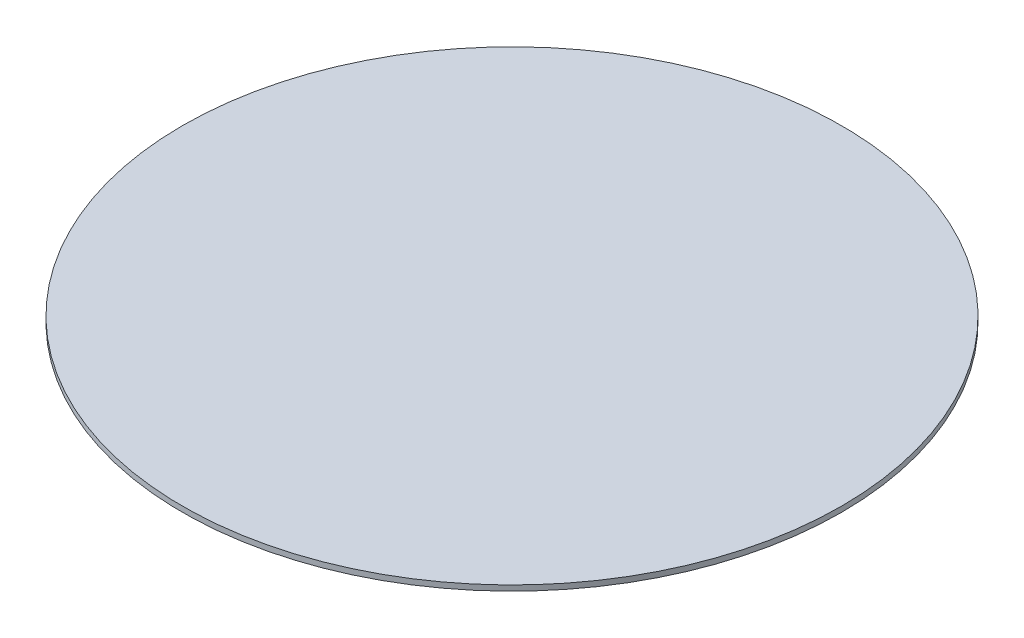
ISO-10303-21;
HEADER;
FILE_DESCRIPTION(('STEP AP214'),'2;1');
FILE_NAME('part.step','',(''),(''),'','','');
FILE_SCHEMA(('AUTOMOTIVE_DESIGN { 1 0 10303 214 1 1 1 1 }'));
ENDSEC;
DATA;
#1=APPLICATION_CONTEXT('core data for automotive mechanical design processes');
#2=APPLICATION_PROTOCOL_DEFINITION('international standard','automotive_design',2000,#1);
#3=PRODUCT_CONTEXT('',#1,'mechanical');
#4=PRODUCT('Part','Part','',(#3));
#5=PRODUCT_RELATED_PRODUCT_CATEGORY('part','',(#4));
#6=PRODUCT_DEFINITION_FORMATION('','',#4);
#7=PRODUCT_DEFINITION_CONTEXT('part definition',#1,'design');
#8=PRODUCT_DEFINITION('design','',#6,#7);
#9=PRODUCT_DEFINITION_SHAPE('','',#8);
#10=(LENGTH_UNIT() NAMED_UNIT(*) SI_UNIT(.MILLI.,.METRE.));
#11=(NAMED_UNIT(*) PLANE_ANGLE_UNIT() SI_UNIT($,.RADIAN.));
#12=(NAMED_UNIT(*) SI_UNIT($,.STERADIAN.) SOLID_ANGLE_UNIT());
#13=UNCERTAINTY_MEASURE_WITH_UNIT(LENGTH_MEASURE(1.E-05),#10,'distance_accuracy_value','');
#14=(GEOMETRIC_REPRESENTATION_CONTEXT(3) GLOBAL_UNCERTAINTY_ASSIGNED_CONTEXT((#13)) GLOBAL_UNIT_ASSIGNED_CONTEXT((#10,
#11,#12)) REPRESENTATION_CONTEXT('',''));
#15=CARTESIAN_POINT('',(0.,0.,0.));
#16=DIRECTION('',(0.,0.,1.));
#17=DIRECTION('',(1.,0.,0.));
#18=AXIS2_PLACEMENT_3D('',#15,#16,#17);
#19=CARTESIAN_POINT('',(0.,16.4,0.));
#20=DIRECTION('',(0.,1.,0.));
#21=DIRECTION('',(-1.,0.,0.));
#22=AXIS2_PLACEMENT_3D('',#19,#20,#21);
#23=PLANE('',#22);
#24=CARTESIAN_POINT('',(0.,16.4,0.));
#25=DIRECTION('',(0.,-1.,0.));
#26=DIRECTION('',(1.,0.,0.));
#27=AXIS2_PLACEMENT_3D('',#24,#25,#26);
#28=CIRCLE('',#27,61.);
#29=CARTESIAN_POINT('',(61.,16.4,0.));
#30=VERTEX_POINT('',#29);
#31=EDGE_CURVE('E10',#30,#30,#28,.T.);
#32=ORIENTED_EDGE('',*,*,#31,.T.);
#33=EDGE_LOOP('',(#32));
#34=FACE_BOUND('',#33,.T.);
#35=ADVANCED_FACE('F35',(#34),#23,.F.);
#36=CARTESIAN_POINT('',(0.,0.,0.));
#37=DIRECTION('',(0.,-1.,0.));
#38=DIRECTION('',(1.,0.,0.));
#39=AXIS2_PLACEMENT_3D('',#36,#37,#38);
#40=CYLINDRICAL_SURFACE('',#39,61.);
#41=ORIENTED_EDGE('',*,*,#31,.F.);
#42=EDGE_LOOP('',(#41));
#43=FACE_BOUND('',#42,.T.);
#44=CARTESIAN_POINT('',(0.,17.4,0.));
#45=DIRECTION('',(0.,-1.,0.));
#46=DIRECTION('',(1.,0.,0.));
#47=AXIS2_PLACEMENT_3D('',#44,#45,#46);
#48=CIRCLE('',#47,61.);
#49=CARTESIAN_POINT('',(61.,17.4,0.));
#50=VERTEX_POINT('',#49);
#51=EDGE_CURVE('E41',#50,#50,#48,.T.);
#52=ORIENTED_EDGE('',*,*,#51,.T.);
#53=EDGE_LOOP('',(#52));
#54=FACE_BOUND('',#53,.T.);
#55=ADVANCED_FACE('F47',(#43,#54),#40,.T.);
#56=CARTESIAN_POINT('',(-61.,17.4,0.));
#57=DIRECTION('',(0.,-1.,0.));
#58=DIRECTION('',(1.,0.,0.));
#59=AXIS2_PLACEMENT_3D('',#56,#57,#58);
#60=PLANE('',#59);
#61=ORIENTED_EDGE('',*,*,#51,.F.);
#62=EDGE_LOOP('',(#61));
#63=FACE_BOUND('',#62,.T.);
#64=ADVANCED_FACE('F49',(#63),#60,.F.);
#65=CLOSED_SHELL('',(#35,#55,#64));
#66=MANIFOLD_SOLID_BREP('B2',#65);
#67=ADVANCED_BREP_SHAPE_REPRESENTATION('',(#18,#66),#14);
#68=SHAPE_DEFINITION_REPRESENTATION(#9,#67);
ENDSEC;
END-ISO-10303-21;
